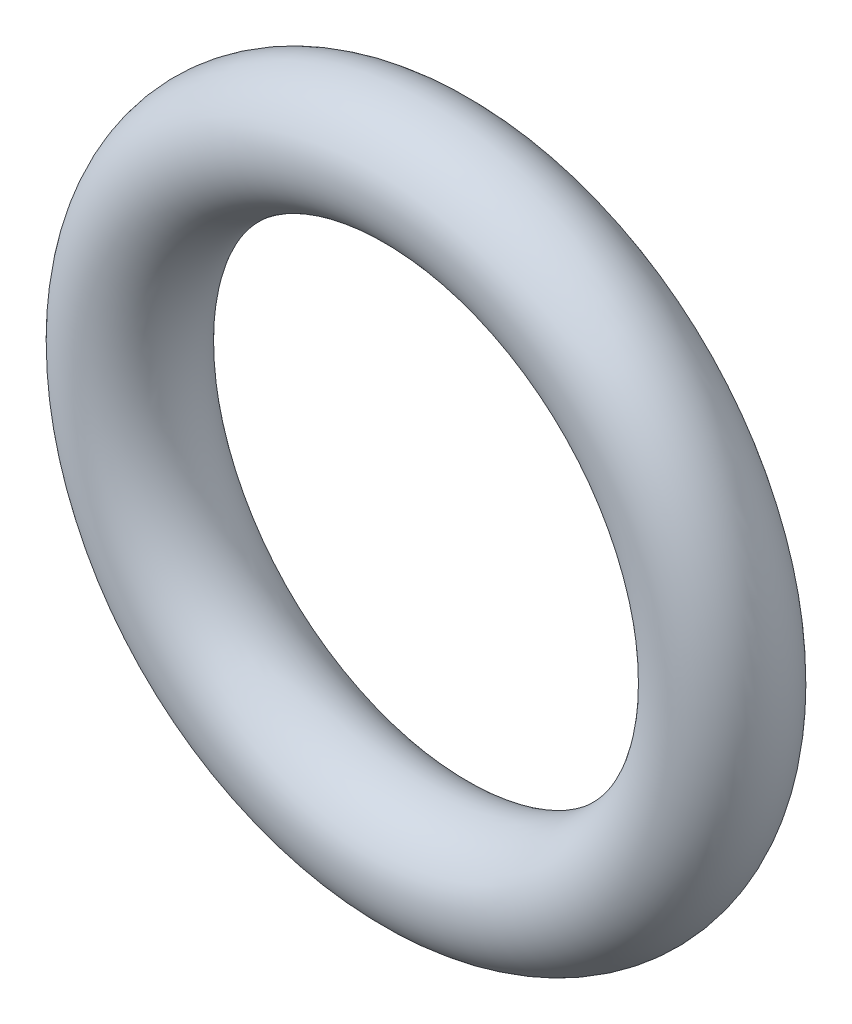
ISO-10303-21;
HEADER;
FILE_DESCRIPTION(('STEP AP214'),'2;1');
FILE_NAME('part.step','',(''),(''),'','','');
FILE_SCHEMA(('AUTOMOTIVE_DESIGN { 1 0 10303 214 1 1 1 1 }'));
ENDSEC;
DATA;
#1=APPLICATION_CONTEXT('core data for automotive mechanical design processes');
#2=APPLICATION_PROTOCOL_DEFINITION('international standard','automotive_design',2000,#1);
#3=PRODUCT_CONTEXT('',#1,'mechanical');
#4=PRODUCT('Part','Part','',(#3));
#5=PRODUCT_RELATED_PRODUCT_CATEGORY('part','',(#4));
#6=PRODUCT_DEFINITION_FORMATION('','',#4);
#7=PRODUCT_DEFINITION_CONTEXT('part definition',#1,'design');
#8=PRODUCT_DEFINITION('design','',#6,#7);
#9=PRODUCT_DEFINITION_SHAPE('','',#8);
#10=(LENGTH_UNIT() NAMED_UNIT(*) SI_UNIT(.MILLI.,.METRE.));
#11=(NAMED_UNIT(*) PLANE_ANGLE_UNIT() SI_UNIT($,.RADIAN.));
#12=(NAMED_UNIT(*) SI_UNIT($,.STERADIAN.) SOLID_ANGLE_UNIT());
#13=UNCERTAINTY_MEASURE_WITH_UNIT(LENGTH_MEASURE(1.E-05),#10,'distance_accuracy_value','');
#14=(GEOMETRIC_REPRESENTATION_CONTEXT(3) GLOBAL_UNCERTAINTY_ASSIGNED_CONTEXT((#13)) GLOBAL_UNIT_ASSIGNED_CONTEXT((#10,
#11,#12)) REPRESENTATION_CONTEXT('',''));
#15=CARTESIAN_POINT('',(0.,0.,0.));
#16=DIRECTION('',(0.,0.,1.));
#17=DIRECTION('',(1.,0.,0.));
#18=AXIS2_PLACEMENT_3D('',#15,#16,#17);
#19=CARTESIAN_POINT('',(0.,0.,0.));
#20=DIRECTION('',(0.,0.,1.));
#21=DIRECTION('',(1.,0.,0.));
#22=AXIS2_PLACEMENT_3D('',#19,#20,#21);
#23=TOROIDAL_SURFACE('',#22,10.,2.);
#24=CARTESIAN_POINT('',(12.,0.,0.));
#25=VERTEX_POINT('',#24);
#26=VERTEX_LOOP('',#25);
#27=FACE_BOUND('',#26,.T.);
#28=ADVANCED_FACE('F30',(#27),#23,.T.);
#29=CLOSED_SHELL('',(#28));
#30=MANIFOLD_SOLID_BREP('B2',#29);
#31=ADVANCED_BREP_SHAPE_REPRESENTATION('',(#18,#30),#14);
#32=SHAPE_DEFINITION_REPRESENTATION(#9,#31);
ENDSEC;
END-ISO-10303-21;
